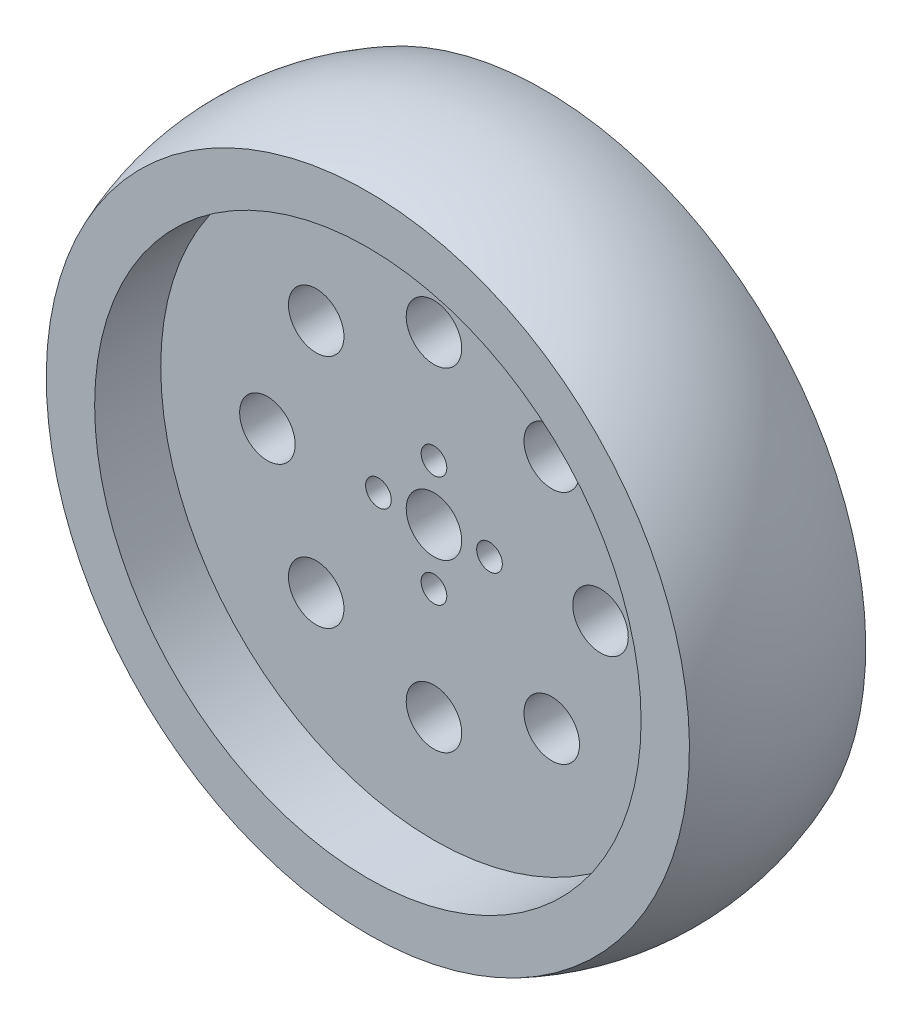
ISO-10303-21;
HEADER;
FILE_DESCRIPTION(('STEP AP214'),'2;1');
FILE_NAME('part.step','',(''),(''),'','','');
FILE_SCHEMA(('AUTOMOTIVE_DESIGN { 1 0 10303 214 1 1 1 1 }'));
ENDSEC;
DATA;
#1=APPLICATION_CONTEXT('core data for automotive mechanical design processes');
#2=APPLICATION_PROTOCOL_DEFINITION('international standard','automotive_design',2000,#1);
#3=PRODUCT_CONTEXT('',#1,'mechanical');
#4=PRODUCT('Part','Part','',(#3));
#5=PRODUCT_RELATED_PRODUCT_CATEGORY('part','',(#4));
#6=PRODUCT_DEFINITION_FORMATION('','',#4);
#7=PRODUCT_DEFINITION_CONTEXT('part definition',#1,'design');
#8=PRODUCT_DEFINITION('design','',#6,#7);
#9=PRODUCT_DEFINITION_SHAPE('','',#8);
#10=(LENGTH_UNIT() NAMED_UNIT(*) SI_UNIT(.MILLI.,.METRE.));
#11=(NAMED_UNIT(*) PLANE_ANGLE_UNIT() SI_UNIT($,.RADIAN.));
#12=(NAMED_UNIT(*) SI_UNIT($,.STERADIAN.) SOLID_ANGLE_UNIT());
#13=UNCERTAINTY_MEASURE_WITH_UNIT(LENGTH_MEASURE(1.E-05),#10,'distance_accuracy_value','');
#14=(GEOMETRIC_REPRESENTATION_CONTEXT(3) GLOBAL_UNCERTAINTY_ASSIGNED_CONTEXT((#13)) GLOBAL_UNIT_ASSIGNED_CONTEXT((#10,
#11,#12)) REPRESENTATION_CONTEXT('',''));
#15=CARTESIAN_POINT('',(0.,0.,0.));
#16=DIRECTION('',(0.,0.,1.));
#17=DIRECTION('',(1.,0.,0.));
#18=AXIS2_PLACEMENT_3D('',#15,#16,#17);
#19=CARTESIAN_POINT('',(0.,0.,-12.7));
#20=DIRECTION('',(0.,0.,1.));
#21=DIRECTION('',(0.,-1.,0.));
#22=AXIS2_PLACEMENT_3D('',#19,#20,#21);
#23=PLANE('',#22);
#24=CARTESIAN_POINT('',(0.,0.,-12.7));
#25=DIRECTION('',(0.,0.,1.));
#26=DIRECTION('',(0.,-1.,0.));
#27=AXIS2_PLACEMENT_3D('',#24,#25,#26);
#28=CIRCLE('',#27,39.37);
#29=CARTESIAN_POINT('',(0.,-39.37,-12.7));
#30=VERTEX_POINT('',#29);
#31=EDGE_CURVE('E113',#30,#30,#28,.T.);
#32=ORIENTED_EDGE('',*,*,#31,.T.);
#33=EDGE_LOOP('',(#32));
#34=FACE_BOUND('',#33,.T.);
#35=CARTESIAN_POINT('',(0.,0.,-12.7));
#36=DIRECTION('',(0.,0.,1.));
#37=DIRECTION('',(0.,-1.,0.));
#38=AXIS2_PLACEMENT_3D('',#35,#36,#37);
#39=CIRCLE('',#38,46.339023447152);
#40=CARTESIAN_POINT('',(0.,-46.339023447152,-12.7));
#41=VERTEX_POINT('',#40);
#42=EDGE_CURVE('E17',#41,#41,#39,.T.);
#43=ORIENTED_EDGE('',*,*,#42,.F.);
#44=EDGE_LOOP('',(#43));
#45=FACE_BOUND('',#44,.T.);
#46=ADVANCED_FACE('F14',(#34,#45),#23,.F.);
#47=CARTESIAN_POINT('',(0.,14.8000000000001,0.));
#48=DIRECTION('',(-1.,0.,0.));
#49=DIRECTION('',(0.,1.,0.));
#50=AXIS2_PLACEMENT_3D('',#47,#48,#49);
#51=CIRCLE('',#50,34.);
#52=TRIMMED_CURVE('',#51,(PARAMETER_VALUE(-2.02116127050727)),
(PARAMETER_VALUE(2.02116127050727)),.T.,.PARAMETER.);
#53=CARTESIAN_POINT('',(0.,0.,0.));
#54=DIRECTION('',(0.,0.,1.));
#55=AXIS1_PLACEMENT('',#53,#54);
#56=SURFACE_OF_REVOLUTION('',#52,#55);
#57=ORIENTED_EDGE('',*,*,#42,.T.);
#58=EDGE_LOOP('',(#57));
#59=FACE_BOUND('',#58,.T.);
#60=CARTESIAN_POINT('',(0.,0.,12.7));
#61=DIRECTION('',(0.,0.,1.));
#62=DIRECTION('',(0.,-1.,0.));
#63=AXIS2_PLACEMENT_3D('',#60,#61,#62);
#64=CIRCLE('',#63,46.339023447152);
#65=CARTESIAN_POINT('',(0.,-46.339023447152,12.7));
#66=VERTEX_POINT('',#65);
#67=EDGE_CURVE('E111',#66,#66,#64,.T.);
#68=ORIENTED_EDGE('',*,*,#67,.F.);
#69=EDGE_LOOP('',(#68));
#70=FACE_BOUND('',#69,.T.);
#71=ADVANCED_FACE('F120',(#59,#70),#56,.F.);
#72=CARTESIAN_POINT('',(0.,0.,-13.97));
#73=DIRECTION('',(0.,0.,1.));
#74=DIRECTION('',(0.,-1.,0.));
#75=AXIS2_PLACEMENT_3D('',#72,#73,#74);
#76=CYLINDRICAL_SURFACE('',#75,39.37);
#77=ORIENTED_EDGE('',*,*,#31,.F.);
#78=EDGE_LOOP('',(#77));
#79=FACE_BOUND('',#78,.T.);
#80=CARTESIAN_POINT('',(0.,0.,-3.17500000000001));
#81=DIRECTION('',(0.,0.,1.));
#82=DIRECTION('',(0.,-1.,0.));
#83=AXIS2_PLACEMENT_3D('',#80,#81,#82);
#84=CIRCLE('',#83,39.37);
#85=CARTESIAN_POINT('',(0.,-39.37,-3.175));
#86=VERTEX_POINT('',#85);
#87=EDGE_CURVE('E108',#86,#86,#84,.T.);
#88=ORIENTED_EDGE('',*,*,#87,.T.);
#89=EDGE_LOOP('',(#88));
#90=FACE_BOUND('',#89,.T.);
#91=ADVANCED_FACE('F128',(#79,#90),#76,.F.);
#92=CARTESIAN_POINT('',(0.,0.,12.7));
#93=DIRECTION('',(0.,0.,1.));
#94=DIRECTION('',(0.,-1.,0.));
#95=AXIS2_PLACEMENT_3D('',#92,#93,#94);
#96=PLANE('',#95);
#97=CARTESIAN_POINT('',(0.,0.,12.7));
#98=DIRECTION('',(0.,0.,1.));
#99=DIRECTION('',(0.,-1.,0.));
#100=AXIS2_PLACEMENT_3D('',#97,#98,#99);
#101=CIRCLE('',#100,39.37);
#102=CARTESIAN_POINT('',(0.,-39.37,12.7));
#103=VERTEX_POINT('',#102);
#104=EDGE_CURVE('E105',#103,#103,#101,.F.);
#105=ORIENTED_EDGE('',*,*,#104,.T.);
#106=EDGE_LOOP('',(#105));
#107=FACE_BOUND('',#106,.T.);
#108=ORIENTED_EDGE('',*,*,#67,.T.);
#109=EDGE_LOOP('',(#108));
#110=FACE_BOUND('',#109,.T.);
#111=ADVANCED_FACE('F195',(#107,#110),#96,.T.);
#112=CARTESIAN_POINT('',(0.,0.,-3.17500000000001));
#113=DIRECTION('',(0.,0.,1.));
#114=DIRECTION('',(0.,-1.,0.));
#115=AXIS2_PLACEMENT_3D('',#112,#113,#114);
#116=PLANE('',#115);
#117=CARTESIAN_POINT('',(-16.9705627484771,-16.9705627484771,-3.17500000000001));
#118=DIRECTION('',(0.,0.,-1.));
#119=DIRECTION('',(0.,1.,0.));
#120=AXIS2_PLACEMENT_3D('',#117,#118,#119);
#121=CIRCLE('',#120,4.);
#122=CARTESIAN_POINT('',(-16.9705627484771,-12.9705627484771,-3.17500000000001));
#123=VERTEX_POINT('',#122);
#124=EDGE_CURVE('E66',#123,#123,#121,.F.);
#125=ORIENTED_EDGE('',*,*,#124,.T.);
#126=EDGE_LOOP('',(#125));
#127=FACE_BOUND('',#126,.T.);
#128=CARTESIAN_POINT('',(-24.,0.,-3.17500000000001));
#129=DIRECTION('',(0.,0.,-1.));
#130=DIRECTION('',(0.,1.,0.));
#131=AXIS2_PLACEMENT_3D('',#128,#129,#130);
#132=CIRCLE('',#131,4.);
#133=CARTESIAN_POINT('',(-24.,4.00000000000001,-3.17500000000001));
#134=VERTEX_POINT('',#133);
#135=EDGE_CURVE('E69',#134,#134,#132,.F.);
#136=ORIENTED_EDGE('',*,*,#135,.T.);
#137=EDGE_LOOP('',(#136));
#138=FACE_BOUND('',#137,.T.);
#139=CARTESIAN_POINT('',(-16.9705627484771,16.9705627484771,-3.17500000000001));
#140=DIRECTION('',(0.,0.,-1.));
#141=DIRECTION('',(0.,1.,0.));
#142=AXIS2_PLACEMENT_3D('',#139,#140,#141);
#143=CIRCLE('',#142,4.);
#144=CARTESIAN_POINT('',(-16.9705627484771,20.9705627484771,-3.17500000000001));
#145=VERTEX_POINT('',#144);
#146=EDGE_CURVE('E72',#145,#145,#143,.F.);
#147=ORIENTED_EDGE('',*,*,#146,.T.);
#148=EDGE_LOOP('',(#147));
#149=FACE_BOUND('',#148,.T.);
#150=CARTESIAN_POINT('',(0.,24.,-3.17500000000001));
#151=DIRECTION('',(0.,0.,-1.));
#152=DIRECTION('',(0.,1.,0.));
#153=AXIS2_PLACEMENT_3D('',#150,#151,#152);
#154=CIRCLE('',#153,4.);
#155=CARTESIAN_POINT('',(0.,28.,-3.17500000000001));
#156=VERTEX_POINT('',#155);
#157=EDGE_CURVE('E75',#156,#156,#154,.F.);
#158=ORIENTED_EDGE('',*,*,#157,.T.);
#159=EDGE_LOOP('',(#158));
#160=FACE_BOUND('',#159,.T.);
#161=CARTESIAN_POINT('',(16.9705627484771,16.9705627484771,-3.175));
#162=DIRECTION('',(0.,0.,-1.));
#163=DIRECTION('',(0.,1.,0.));
#164=AXIS2_PLACEMENT_3D('',#161,#162,#163);
#165=CIRCLE('',#164,4.);
#166=CARTESIAN_POINT('',(16.9705627484771,20.9705627484771,-3.175));
#167=VERTEX_POINT('',#166);
#168=EDGE_CURVE('E78',#167,#167,#165,.F.);
#169=ORIENTED_EDGE('',*,*,#168,.T.);
#170=EDGE_LOOP('',(#169));
#171=FACE_BOUND('',#170,.T.);
#172=CARTESIAN_POINT('',(24.,0.,-3.17500000000001));
#173=DIRECTION('',(0.,0.,-1.));
#174=DIRECTION('',(0.,1.,0.));
#175=AXIS2_PLACEMENT_3D('',#172,#173,#174);
#176=CIRCLE('',#175,4.);
#177=CARTESIAN_POINT('',(24.,4.,-3.17500000000001));
#178=VERTEX_POINT('',#177);
#179=EDGE_CURVE('E81',#178,#178,#176,.F.);
#180=ORIENTED_EDGE('',*,*,#179,.T.);
#181=EDGE_LOOP('',(#180));
#182=FACE_BOUND('',#181,.T.);
#183=CARTESIAN_POINT('',(16.9705627484771,-16.9705627484771,-3.175));
#184=DIRECTION('',(0.,0.,-1.));
#185=DIRECTION('',(0.,1.,0.));
#186=AXIS2_PLACEMENT_3D('',#183,#184,#185);
#187=CIRCLE('',#186,4.);
#188=CARTESIAN_POINT('',(16.9705627484771,-12.9705627484771,-3.175));
#189=VERTEX_POINT('',#188);
#190=EDGE_CURVE('E84',#189,#189,#187,.F.);
#191=ORIENTED_EDGE('',*,*,#190,.T.);
#192=EDGE_LOOP('',(#191));
#193=FACE_BOUND('',#192,.T.);
#194=CARTESIAN_POINT('',(0.,-24.,-3.175));
#195=DIRECTION('',(0.,0.,-1.));
#196=DIRECTION('',(0.,1.,0.));
#197=AXIS2_PLACEMENT_3D('',#194,#195,#196);
#198=CIRCLE('',#197,4.);
#199=CARTESIAN_POINT('',(0.,-20.,-3.175));
#200=VERTEX_POINT('',#199);
#201=EDGE_CURVE('E87',#200,#200,#198,.F.);
#202=ORIENTED_EDGE('',*,*,#201,.T.);
#203=EDGE_LOOP('',(#202));
#204=FACE_BOUND('',#203,.T.);
#205=CARTESIAN_POINT('',(0.,8.,-3.17500000000001));
#206=DIRECTION('',(0.,0.,1.));
#207=DIRECTION('',(1.,0.,0.));
#208=AXIS2_PLACEMENT_3D('',#205,#206,#207);
#209=CIRCLE('',#208,1.85);
#210=CARTESIAN_POINT('',(1.85,8.,-3.17500000000001));
#211=VERTEX_POINT('',#210);
#212=EDGE_CURVE('E90',#211,#211,#209,.T.);
#213=ORIENTED_EDGE('',*,*,#212,.T.);
#214=EDGE_LOOP('',(#213));
#215=FACE_BOUND('',#214,.T.);
#216=CARTESIAN_POINT('',(-8.,0.,-3.175));
#217=DIRECTION('',(0.,0.,1.));
#218=DIRECTION('',(1.,0.,0.));
#219=AXIS2_PLACEMENT_3D('',#216,#217,#218);
#220=CIRCLE('',#219,1.85);
#221=CARTESIAN_POINT('',(-6.15,0.,-3.175));
#222=VERTEX_POINT('',#221);
#223=EDGE_CURVE('E93',#222,#222,#220,.T.);
#224=ORIENTED_EDGE('',*,*,#223,.T.);
#225=EDGE_LOOP('',(#224));
#226=FACE_BOUND('',#225,.T.);
#227=CARTESIAN_POINT('',(0.,-8.,-3.175));
#228=DIRECTION('',(0.,0.,1.));
#229=DIRECTION('',(1.,0.,0.));
#230=AXIS2_PLACEMENT_3D('',#227,#228,#229);
#231=CIRCLE('',#230,1.85);
#232=CARTESIAN_POINT('',(1.85,-8.,-3.175));
#233=VERTEX_POINT('',#232);
#234=EDGE_CURVE('E96',#233,#233,#231,.T.);
#235=ORIENTED_EDGE('',*,*,#234,.T.);
#236=EDGE_LOOP('',(#235));
#237=FACE_BOUND('',#236,.T.);
#238=CARTESIAN_POINT('',(8.,0.,-3.175));
#239=DIRECTION('',(0.,0.,1.));
#240=DIRECTION('',(1.,0.,0.));
#241=AXIS2_PLACEMENT_3D('',#238,#239,#240);
#242=CIRCLE('',#241,1.85);
#243=CARTESIAN_POINT('',(9.85,0.,-3.175));
#244=VERTEX_POINT('',#243);
#245=EDGE_CURVE('E99',#244,#244,#242,.T.);
#246=ORIENTED_EDGE('',*,*,#245,.T.);
#247=EDGE_LOOP('',(#246));
#248=FACE_BOUND('',#247,.T.);
#249=CARTESIAN_POINT('',(0.,0.,-3.17500000000001));
#250=DIRECTION('',(0.,0.,1.));
#251=DIRECTION('',(0.,-1.,0.));
#252=AXIS2_PLACEMENT_3D('',#249,#250,#251);
#253=CIRCLE('',#252,4.);
#254=CARTESIAN_POINT('',(0.,-4.,-3.17500000000001));
#255=VERTEX_POINT('',#254);
#256=EDGE_CURVE('E102',#255,#255,#253,.T.);
#257=ORIENTED_EDGE('',*,*,#256,.T.);
#258=EDGE_LOOP('',(#257));
#259=FACE_BOUND('',#258,.T.);
#260=ORIENTED_EDGE('',*,*,#87,.F.);
#261=EDGE_LOOP('',(#260));
#262=FACE_BOUND('',#261,.T.);
#263=ADVANCED_FACE('F191',(#127,#138,#149,#160,#171,#182,#193,#204,#215,#226,#237,#248,#259,
#262),#116,.F.);
#264=CARTESIAN_POINT('',(0.,0.,-13.97));
#265=DIRECTION('',(0.,0.,1.));
#266=DIRECTION('',(0.,-1.,0.));
#267=AXIS2_PLACEMENT_3D('',#264,#265,#266);
#268=CYLINDRICAL_SURFACE('',#267,39.37);
#269=ORIENTED_EDGE('',*,*,#104,.F.);
#270=EDGE_LOOP('',(#269));
#271=FACE_BOUND('',#270,.T.);
#272=CARTESIAN_POINT('',(0.,0.,3.17499999999999));
#273=DIRECTION('',(0.,0.,1.));
#274=DIRECTION('',(0.,-1.,0.));
#275=AXIS2_PLACEMENT_3D('',#272,#273,#274);
#276=CIRCLE('',#275,39.37);
#277=CARTESIAN_POINT('',(0.,-39.37,3.175));
#278=VERTEX_POINT('',#277);
#279=EDGE_CURVE('E63',#278,#278,#276,.T.);
#280=ORIENTED_EDGE('',*,*,#279,.F.);
#281=EDGE_LOOP('',(#280));
#282=FACE_BOUND('',#281,.T.);
#283=ADVANCED_FACE('F187',(#271,#282),#268,.F.);
#284=CARTESIAN_POINT('',(0.,0.,-3.17500000000001));
#285=DIRECTION('',(0.,0.,1.));
#286=DIRECTION('',(0.,-1.,0.));
#287=AXIS2_PLACEMENT_3D('',#284,#285,#286);
#288=CYLINDRICAL_SURFACE('',#287,4.);
#289=CARTESIAN_POINT('',(0.,0.,3.175));
#290=DIRECTION('',(0.,0.,1.));
#291=DIRECTION('',(0.,-1.,0.));
#292=AXIS2_PLACEMENT_3D('',#289,#290,#291);
#293=CIRCLE('',#292,4.);
#294=CARTESIAN_POINT('',(0.,-4.,3.17500000000001));
#295=VERTEX_POINT('',#294);
#296=EDGE_CURVE('E60',#295,#295,#293,.F.);
#297=ORIENTED_EDGE('',*,*,#296,.F.);
#298=EDGE_LOOP('',(#297));
#299=FACE_BOUND('',#298,.T.);
#300=ORIENTED_EDGE('',*,*,#256,.F.);
#301=EDGE_LOOP('',(#300));
#302=FACE_BOUND('',#301,.T.);
#303=ADVANCED_FACE('F183',(#299,#302),#288,.F.);
#304=CARTESIAN_POINT('',(8.,0.,-15.24));
#305=DIRECTION('',(0.,0.,1.));
#306=DIRECTION('',(1.,0.,0.));
#307=AXIS2_PLACEMENT_3D('',#304,#305,#306);
#308=CYLINDRICAL_SURFACE('',#307,1.85);
#309=CARTESIAN_POINT('',(8.,0.,3.175));
#310=DIRECTION('',(0.,0.,1.));
#311=DIRECTION('',(1.,0.,0.));
#312=AXIS2_PLACEMENT_3D('',#309,#310,#311);
#313=CIRCLE('',#312,1.85);
#314=CARTESIAN_POINT('',(9.85,0.,3.175));
#315=VERTEX_POINT('',#314);
#316=EDGE_CURVE('E57',#315,#315,#313,.F.);
#317=ORIENTED_EDGE('',*,*,#316,.F.);
#318=EDGE_LOOP('',(#317));
#319=FACE_BOUND('',#318,.T.);
#320=ORIENTED_EDGE('',*,*,#245,.F.);
#321=EDGE_LOOP('',(#320));
#322=FACE_BOUND('',#321,.T.);
#323=ADVANCED_FACE('F179',(#319,#322),#308,.F.);
#324=CARTESIAN_POINT('',(0.,-8.,-15.24));
#325=DIRECTION('',(0.,0.,1.));
#326=DIRECTION('',(1.,0.,0.));
#327=AXIS2_PLACEMENT_3D('',#324,#325,#326);
#328=CYLINDRICAL_SURFACE('',#327,1.85);
#329=CARTESIAN_POINT('',(0.,-8.,3.175));
#330=DIRECTION('',(0.,0.,1.));
#331=DIRECTION('',(1.,0.,0.));
#332=AXIS2_PLACEMENT_3D('',#329,#330,#331);
#333=CIRCLE('',#332,1.85);
#334=CARTESIAN_POINT('',(1.85,-8.,3.175));
#335=VERTEX_POINT('',#334);
#336=EDGE_CURVE('E54',#335,#335,#333,.F.);
#337=ORIENTED_EDGE('',*,*,#336,.F.);
#338=EDGE_LOOP('',(#337));
#339=FACE_BOUND('',#338,.T.);
#340=ORIENTED_EDGE('',*,*,#234,.F.);
#341=EDGE_LOOP('',(#340));
#342=FACE_BOUND('',#341,.T.);
#343=ADVANCED_FACE('F175',(#339,#342),#328,.F.);
#344=CARTESIAN_POINT('',(-8.,0.,-15.24));
#345=DIRECTION('',(0.,0.,1.));
#346=DIRECTION('',(1.,0.,0.));
#347=AXIS2_PLACEMENT_3D('',#344,#345,#346);
#348=CYLINDRICAL_SURFACE('',#347,1.85);
#349=CARTESIAN_POINT('',(-8.,0.,3.175));
#350=DIRECTION('',(0.,0.,1.));
#351=DIRECTION('',(1.,0.,0.));
#352=AXIS2_PLACEMENT_3D('',#349,#350,#351);
#353=CIRCLE('',#352,1.85);
#354=CARTESIAN_POINT('',(-6.15,0.,3.175));
#355=VERTEX_POINT('',#354);
#356=EDGE_CURVE('E51',#355,#355,#353,.F.);
#357=ORIENTED_EDGE('',*,*,#356,.F.);
#358=EDGE_LOOP('',(#357));
#359=FACE_BOUND('',#358,.T.);
#360=ORIENTED_EDGE('',*,*,#223,.F.);
#361=EDGE_LOOP('',(#360));
#362=FACE_BOUND('',#361,.T.);
#363=ADVANCED_FACE('F171',(#359,#362),#348,.F.);
#364=CARTESIAN_POINT('',(0.,8.,-15.24));
#365=DIRECTION('',(0.,0.,1.));
#366=DIRECTION('',(1.,0.,0.));
#367=AXIS2_PLACEMENT_3D('',#364,#365,#366);
#368=CYLINDRICAL_SURFACE('',#367,1.85);
#369=CARTESIAN_POINT('',(0.,8.,3.175));
#370=DIRECTION('',(0.,0.,1.));
#371=DIRECTION('',(1.,0.,0.));
#372=AXIS2_PLACEMENT_3D('',#369,#370,#371);
#373=CIRCLE('',#372,1.85);
#374=CARTESIAN_POINT('',(1.85,8.,3.175));
#375=VERTEX_POINT('',#374);
#376=EDGE_CURVE('E48',#375,#375,#373,.F.);
#377=ORIENTED_EDGE('',*,*,#376,.F.);
#378=EDGE_LOOP('',(#377));
#379=FACE_BOUND('',#378,.T.);
#380=ORIENTED_EDGE('',*,*,#212,.F.);
#381=EDGE_LOOP('',(#380));
#382=FACE_BOUND('',#381,.T.);
#383=ADVANCED_FACE('F167',(#379,#382),#368,.F.);
#384=CARTESIAN_POINT('',(0.,-24.,3.17500000000001));
#385=DIRECTION('',(0.,0.,-1.));
#386=DIRECTION('',(0.,1.,0.));
#387=AXIS2_PLACEMENT_3D('',#384,#385,#386);
#388=CYLINDRICAL_SURFACE('',#387,4.);
#389=CARTESIAN_POINT('',(0.,-24.,3.17500000000001));
#390=DIRECTION('',(0.,0.,-1.));
#391=DIRECTION('',(0.,1.,0.));
#392=AXIS2_PLACEMENT_3D('',#389,#390,#391);
#393=CIRCLE('',#392,4.);
#394=CARTESIAN_POINT('',(0.,-20.,3.175));
#395=VERTEX_POINT('',#394);
#396=EDGE_CURVE('E45',#395,#395,#393,.T.);
#397=ORIENTED_EDGE('',*,*,#396,.F.);
#398=EDGE_LOOP('',(#397));
#399=FACE_BOUND('',#398,.T.);
#400=ORIENTED_EDGE('',*,*,#201,.F.);
#401=EDGE_LOOP('',(#400));
#402=FACE_BOUND('',#401,.T.);
#403=ADVANCED_FACE('F163',(#399,#402),#388,.F.);
#404=CARTESIAN_POINT('',(16.9705627484771,-16.9705627484771,3.175));
#405=DIRECTION('',(0.,0.,-1.));
#406=DIRECTION('',(0.,1.,0.));
#407=AXIS2_PLACEMENT_3D('',#404,#405,#406);
#408=CYLINDRICAL_SURFACE('',#407,4.);
#409=CARTESIAN_POINT('',(16.9705627484771,-16.9705627484771,3.175));
#410=DIRECTION('',(0.,0.,-1.));
#411=DIRECTION('',(0.,1.,0.));
#412=AXIS2_PLACEMENT_3D('',#409,#410,#411);
#413=CIRCLE('',#412,4.);
#414=CARTESIAN_POINT('',(16.9705627484771,-12.9705627484771,3.175));
#415=VERTEX_POINT('',#414);
#416=EDGE_CURVE('E42',#415,#415,#413,.T.);
#417=ORIENTED_EDGE('',*,*,#416,.F.);
#418=EDGE_LOOP('',(#417));
#419=FACE_BOUND('',#418,.T.);
#420=ORIENTED_EDGE('',*,*,#190,.F.);
#421=EDGE_LOOP('',(#420));
#422=FACE_BOUND('',#421,.T.);
#423=ADVANCED_FACE('F159',(#419,#422),#408,.F.);
#424=CARTESIAN_POINT('',(24.,0.,3.175));
#425=DIRECTION('',(0.,0.,-1.));
#426=DIRECTION('',(0.,1.,0.));
#427=AXIS2_PLACEMENT_3D('',#424,#425,#426);
#428=CYLINDRICAL_SURFACE('',#427,4.);
#429=CARTESIAN_POINT('',(24.,0.,3.175));
#430=DIRECTION('',(0.,0.,-1.));
#431=DIRECTION('',(0.,1.,0.));
#432=AXIS2_PLACEMENT_3D('',#429,#430,#431);
#433=CIRCLE('',#432,4.);
#434=CARTESIAN_POINT('',(24.,4.,3.175));
#435=VERTEX_POINT('',#434);
#436=EDGE_CURVE('E39',#435,#435,#433,.T.);
#437=ORIENTED_EDGE('',*,*,#436,.F.);
#438=EDGE_LOOP('',(#437));
#439=FACE_BOUND('',#438,.T.);
#440=ORIENTED_EDGE('',*,*,#179,.F.);
#441=EDGE_LOOP('',(#440));
#442=FACE_BOUND('',#441,.T.);
#443=ADVANCED_FACE('F155',(#439,#442),#428,.F.);
#444=CARTESIAN_POINT('',(16.9705627484771,16.9705627484771,3.175));
#445=DIRECTION('',(0.,0.,-1.));
#446=DIRECTION('',(0.,1.,0.));
#447=AXIS2_PLACEMENT_3D('',#444,#445,#446);
#448=CYLINDRICAL_SURFACE('',#447,4.);
#449=CARTESIAN_POINT('',(16.9705627484771,16.9705627484771,3.175));
#450=DIRECTION('',(0.,0.,-1.));
#451=DIRECTION('',(0.,1.,0.));
#452=AXIS2_PLACEMENT_3D('',#449,#450,#451);
#453=CIRCLE('',#452,4.);
#454=CARTESIAN_POINT('',(16.9705627484771,20.9705627484771,3.175));
#455=VERTEX_POINT('',#454);
#456=EDGE_CURVE('E36',#455,#455,#453,.T.);
#457=ORIENTED_EDGE('',*,*,#456,.F.);
#458=EDGE_LOOP('',(#457));
#459=FACE_BOUND('',#458,.T.);
#460=ORIENTED_EDGE('',*,*,#168,.F.);
#461=EDGE_LOOP('',(#460));
#462=FACE_BOUND('',#461,.T.);
#463=ADVANCED_FACE('F151',(#459,#462),#448,.F.);
#464=CARTESIAN_POINT('',(0.,24.,3.175));
#465=DIRECTION('',(0.,0.,-1.));
#466=DIRECTION('',(0.,1.,0.));
#467=AXIS2_PLACEMENT_3D('',#464,#465,#466);
#468=CYLINDRICAL_SURFACE('',#467,4.);
#469=CARTESIAN_POINT('',(0.,24.,3.175));
#470=DIRECTION('',(0.,0.,-1.));
#471=DIRECTION('',(0.,1.,0.));
#472=AXIS2_PLACEMENT_3D('',#469,#470,#471);
#473=CIRCLE('',#472,4.);
#474=CARTESIAN_POINT('',(0.,28.,3.175));
#475=VERTEX_POINT('',#474);
#476=EDGE_CURVE('E33',#475,#475,#473,.T.);
#477=ORIENTED_EDGE('',*,*,#476,.F.);
#478=EDGE_LOOP('',(#477));
#479=FACE_BOUND('',#478,.T.);
#480=ORIENTED_EDGE('',*,*,#157,.F.);
#481=EDGE_LOOP('',(#480));
#482=FACE_BOUND('',#481,.T.);
#483=ADVANCED_FACE('F147',(#479,#482),#468,.F.);
#484=CARTESIAN_POINT('',(-16.9705627484771,16.9705627484771,3.175));
#485=DIRECTION('',(0.,0.,-1.));
#486=DIRECTION('',(0.,1.,0.));
#487=AXIS2_PLACEMENT_3D('',#484,#485,#486);
#488=CYLINDRICAL_SURFACE('',#487,4.);
#489=CARTESIAN_POINT('',(-16.9705627484771,16.9705627484771,3.175));
#490=DIRECTION('',(0.,0.,-1.));
#491=DIRECTION('',(0.,1.,0.));
#492=AXIS2_PLACEMENT_3D('',#489,#490,#491);
#493=CIRCLE('',#492,4.);
#494=CARTESIAN_POINT('',(-16.9705627484771,20.9705627484771,3.175));
#495=VERTEX_POINT('',#494);
#496=EDGE_CURVE('E26',#495,#495,#493,.T.);
#497=ORIENTED_EDGE('',*,*,#496,.F.);
#498=EDGE_LOOP('',(#497));
#499=FACE_BOUND('',#498,.T.);
#500=ORIENTED_EDGE('',*,*,#146,.F.);
#501=EDGE_LOOP('',(#500));
#502=FACE_BOUND('',#501,.T.);
#503=ADVANCED_FACE('F143',(#499,#502),#488,.F.);
#504=CARTESIAN_POINT('',(-24.,0.,3.175));
#505=DIRECTION('',(0.,0.,-1.));
#506=DIRECTION('',(0.,1.,0.));
#507=AXIS2_PLACEMENT_3D('',#504,#505,#506);
#508=CYLINDRICAL_SURFACE('',#507,4.);
#509=CARTESIAN_POINT('',(-24.,0.,3.175));
#510=DIRECTION('',(0.,0.,-1.));
#511=DIRECTION('',(0.,1.,0.));
#512=AXIS2_PLACEMENT_3D('',#509,#510,#511);
#513=CIRCLE('',#512,4.);
#514=CARTESIAN_POINT('',(-24.,4.00000000000001,3.175));
#515=VERTEX_POINT('',#514);
#516=EDGE_CURVE('E21',#515,#515,#513,.T.);
#517=ORIENTED_EDGE('',*,*,#516,.F.);
#518=EDGE_LOOP('',(#517));
#519=FACE_BOUND('',#518,.T.);
#520=ORIENTED_EDGE('',*,*,#135,.F.);
#521=EDGE_LOOP('',(#520));
#522=FACE_BOUND('',#521,.T.);
#523=ADVANCED_FACE('F136',(#519,#522),#508,.F.);
#524=CARTESIAN_POINT('',(-16.9705627484771,-16.9705627484771,3.175));
#525=DIRECTION('',(0.,0.,-1.));
#526=DIRECTION('',(0.,1.,0.));
#527=AXIS2_PLACEMENT_3D('',#524,#525,#526);
#528=CYLINDRICAL_SURFACE('',#527,4.);
#529=CARTESIAN_POINT('',(-16.9705627484771,-16.9705627484771,3.175));
#530=DIRECTION('',(0.,0.,-1.));
#531=DIRECTION('',(0.,1.,0.));
#532=AXIS2_PLACEMENT_3D('',#529,#530,#531);
#533=CIRCLE('',#532,4.);
#534=CARTESIAN_POINT('',(-16.9705627484771,-12.9705627484771,3.175));
#535=VERTEX_POINT('',#534);
#536=EDGE_CURVE('E10',#535,#535,#533,.T.);
#537=ORIENTED_EDGE('',*,*,#536,.F.);
#538=EDGE_LOOP('',(#537));
#539=FACE_BOUND('',#538,.T.);
#540=ORIENTED_EDGE('',*,*,#124,.F.);
#541=EDGE_LOOP('',(#540));
#542=FACE_BOUND('',#541,.T.);
#543=ADVANCED_FACE('F131',(#539,#542),#528,.F.);
#544=CARTESIAN_POINT('',(0.,0.,3.175));
#545=DIRECTION('',(0.,0.,1.));
#546=DIRECTION('',(0.,-1.,0.));
#547=AXIS2_PLACEMENT_3D('',#544,#545,#546);
#548=PLANE('',#547);
#549=ORIENTED_EDGE('',*,*,#536,.T.);
#550=EDGE_LOOP('',(#549));
#551=FACE_BOUND('',#550,.T.);
#552=ORIENTED_EDGE('',*,*,#516,.T.);
#553=EDGE_LOOP('',(#552));
#554=FACE_BOUND('',#553,.T.);
#555=ORIENTED_EDGE('',*,*,#496,.T.);
#556=EDGE_LOOP('',(#555));
#557=FACE_BOUND('',#556,.T.);
#558=ORIENTED_EDGE('',*,*,#476,.T.);
#559=EDGE_LOOP('',(#558));
#560=FACE_BOUND('',#559,.T.);
#561=ORIENTED_EDGE('',*,*,#456,.T.);
#562=EDGE_LOOP('',(#561));
#563=FACE_BOUND('',#562,.T.);
#564=ORIENTED_EDGE('',*,*,#436,.T.);
#565=EDGE_LOOP('',(#564));
#566=FACE_BOUND('',#565,.T.);
#567=ORIENTED_EDGE('',*,*,#416,.T.);
#568=EDGE_LOOP('',(#567));
#569=FACE_BOUND('',#568,.T.);
#570=ORIENTED_EDGE('',*,*,#396,.T.);
#571=EDGE_LOOP('',(#570));
#572=FACE_BOUND('',#571,.T.);
#573=ORIENTED_EDGE('',*,*,#376,.T.);
#574=EDGE_LOOP('',(#573));
#575=FACE_BOUND('',#574,.T.);
#576=ORIENTED_EDGE('',*,*,#356,.T.);
#577=EDGE_LOOP('',(#576));
#578=FACE_BOUND('',#577,.T.);
#579=ORIENTED_EDGE('',*,*,#336,.T.);
#580=EDGE_LOOP('',(#579));
#581=FACE_BOUND('',#580,.T.);
#582=ORIENTED_EDGE('',*,*,#316,.T.);
#583=EDGE_LOOP('',(#582));
#584=FACE_BOUND('',#583,.T.);
#585=ORIENTED_EDGE('',*,*,#296,.T.);
#586=EDGE_LOOP('',(#585));
#587=FACE_BOUND('',#586,.T.);
#588=ORIENTED_EDGE('',*,*,#279,.T.);
#589=EDGE_LOOP('',(#588));
#590=FACE_BOUND('',#589,.T.);
#591=ADVANCED_FACE('F129',(#551,#554,#557,#560,#563,#566,#569,#572,#575,#578,#581,#584,#587,
#590),#548,.T.);
#592=CLOSED_SHELL('',(#46,#71,#91,#111,#263,#283,#303,#323,#343,#363,#383,#403,#423,#443,#463,
#483,#503,#523,#543,#591));
#593=MANIFOLD_SOLID_BREP('B1',#592);
#594=ADVANCED_BREP_SHAPE_REPRESENTATION('',(#18,#593),#14);
#595=SHAPE_DEFINITION_REPRESENTATION(#9,#594);
ENDSEC;
END-ISO-10303-21;
